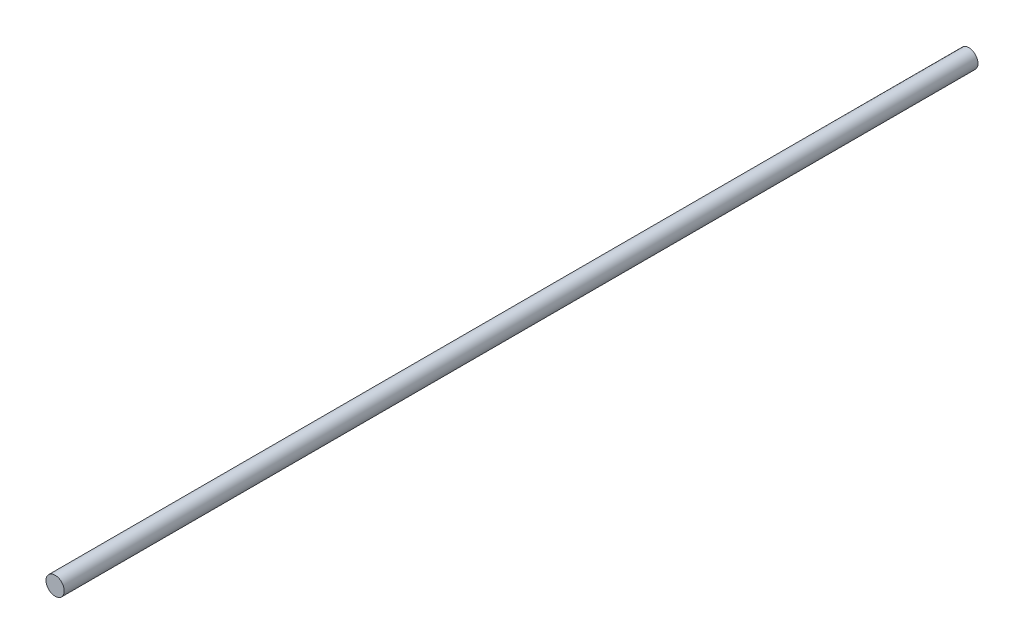
ISO-10303-21;
HEADER;
FILE_DESCRIPTION(('STEP AP214'),'2;1');
FILE_NAME('part.step','',(''),(''),'','','');
FILE_SCHEMA(('AUTOMOTIVE_DESIGN { 1 0 10303 214 1 1 1 1 }'));
ENDSEC;
DATA;
#1=APPLICATION_CONTEXT('core data for automotive mechanical design processes');
#2=APPLICATION_PROTOCOL_DEFINITION('international standard','automotive_design',2000,#1);
#3=PRODUCT_CONTEXT('',#1,'mechanical');
#4=PRODUCT('Part','Part','',(#3));
#5=PRODUCT_RELATED_PRODUCT_CATEGORY('part','',(#4));
#6=PRODUCT_DEFINITION_FORMATION('','',#4);
#7=PRODUCT_DEFINITION_CONTEXT('part definition',#1,'design');
#8=PRODUCT_DEFINITION('design','',#6,#7);
#9=PRODUCT_DEFINITION_SHAPE('','',#8);
#10=(LENGTH_UNIT() NAMED_UNIT(*) SI_UNIT(.MILLI.,.METRE.));
#11=(NAMED_UNIT(*) PLANE_ANGLE_UNIT() SI_UNIT($,.RADIAN.));
#12=(NAMED_UNIT(*) SI_UNIT($,.STERADIAN.) SOLID_ANGLE_UNIT());
#13=UNCERTAINTY_MEASURE_WITH_UNIT(LENGTH_MEASURE(1.E-05),#10,'distance_accuracy_value','');
#14=(GEOMETRIC_REPRESENTATION_CONTEXT(3) GLOBAL_UNCERTAINTY_ASSIGNED_CONTEXT((#13)) GLOBAL_UNIT_ASSIGNED_CONTEXT((#10,
#11,#12)) REPRESENTATION_CONTEXT('',''));
#15=CARTESIAN_POINT('',(0.,0.,0.));
#16=DIRECTION('',(0.,0.,1.));
#17=DIRECTION('',(1.,0.,0.));
#18=AXIS2_PLACEMENT_3D('',#15,#16,#17);
#19=CARTESIAN_POINT('',(0.,0.,250.));
#20=DIRECTION('',(0.,0.,-1.));
#21=DIRECTION('',(-1.,0.,0.));
#22=AXIS2_PLACEMENT_3D('',#19,#20,#21);
#23=CYLINDRICAL_SURFACE('',#22,2.5);
#24=CARTESIAN_POINT('',(0.,0.,250.));
#25=DIRECTION('',(0.,0.,1.));
#26=DIRECTION('',(1.,0.,0.));
#27=AXIS2_PLACEMENT_3D('',#24,#25,#26);
#28=CIRCLE('',#27,2.5);
#29=CARTESIAN_POINT('',(2.5,0.,250.));
#30=VERTEX_POINT('',#29);
#31=EDGE_CURVE('E10',#30,#30,#28,.T.);
#32=ORIENTED_EDGE('',*,*,#31,.F.);
#33=EDGE_LOOP('',(#32));
#34=FACE_BOUND('',#33,.T.);
#35=CARTESIAN_POINT('',(0.,0.,0.));
#36=DIRECTION('',(0.,0.,1.));
#37=DIRECTION('',(1.,0.,0.));
#38=AXIS2_PLACEMENT_3D('',#35,#36,#37);
#39=CIRCLE('',#38,2.5);
#40=CARTESIAN_POINT('',(2.5,0.,0.));
#41=VERTEX_POINT('',#40);
#42=EDGE_CURVE('E36',#41,#41,#39,.T.);
#43=ORIENTED_EDGE('',*,*,#42,.T.);
#44=EDGE_LOOP('',(#43));
#45=FACE_BOUND('',#44,.T.);
#46=ADVANCED_FACE('F33',(#34,#45),#23,.T.);
#47=CARTESIAN_POINT('',(0.,0.,250.));
#48=DIRECTION('',(0.,0.,1.));
#49=DIRECTION('',(1.,0.,0.));
#50=AXIS2_PLACEMENT_3D('',#47,#48,#49);
#51=PLANE('',#50);
#52=ORIENTED_EDGE('',*,*,#31,.T.);
#53=EDGE_LOOP('',(#52));
#54=FACE_BOUND('',#53,.T.);
#55=ADVANCED_FACE('F48',(#54),#51,.T.);
#56=CARTESIAN_POINT('',(0.,0.,0.));
#57=DIRECTION('',(0.,0.,1.));
#58=DIRECTION('',(1.,0.,0.));
#59=AXIS2_PLACEMENT_3D('',#56,#57,#58);
#60=PLANE('',#59);
#61=ORIENTED_EDGE('',*,*,#42,.F.);
#62=EDGE_LOOP('',(#61));
#63=FACE_BOUND('',#62,.T.);
#64=ADVANCED_FACE('F46',(#63),#60,.F.);
#65=CLOSED_SHELL('',(#46,#55,#64));
#66=MANIFOLD_SOLID_BREP('B2',#65);
#67=ADVANCED_BREP_SHAPE_REPRESENTATION('',(#18,#66),#14);
#68=SHAPE_DEFINITION_REPRESENTATION(#9,#67);
ENDSEC;
END-ISO-10303-21;
